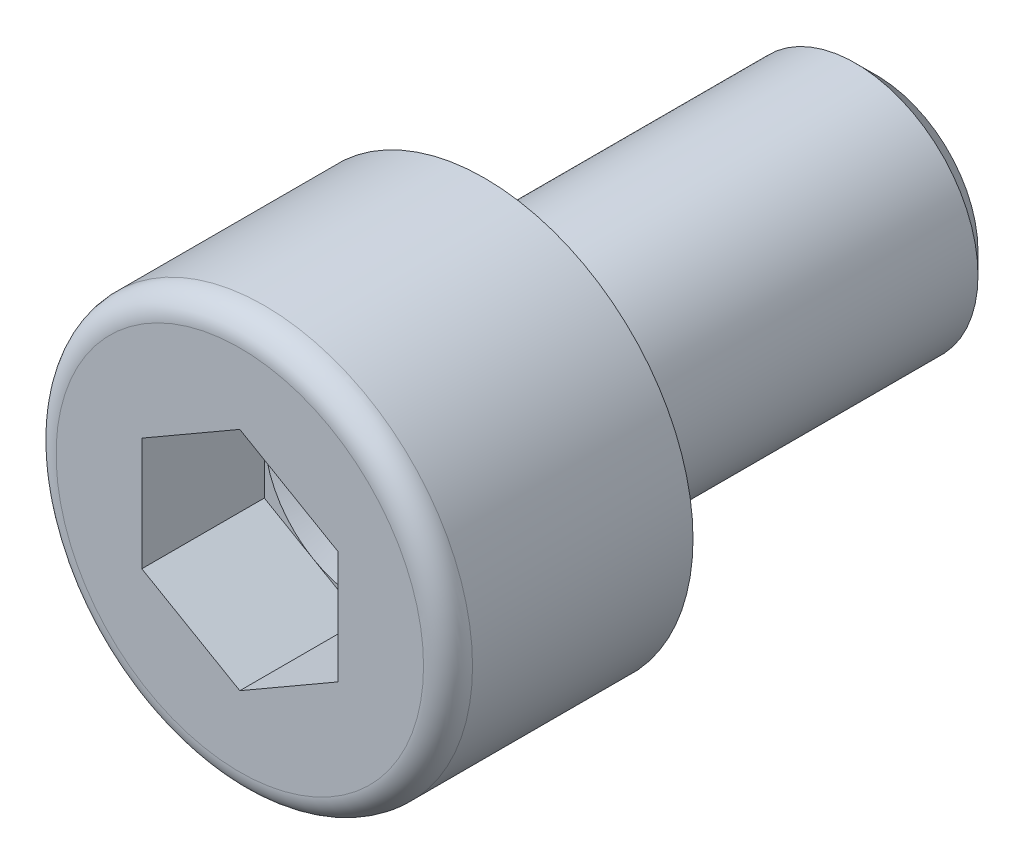
ISO-10303-21;
HEADER;
FILE_DESCRIPTION(('STEP AP214'),'2;1');
FILE_NAME('part.step','',(''),(''),'','','');
FILE_SCHEMA(('AUTOMOTIVE_DESIGN { 1 0 10303 214 1 1 1 1 }'));
ENDSEC;
DATA;
#1=APPLICATION_CONTEXT('core data for automotive mechanical design processes');
#2=APPLICATION_PROTOCOL_DEFINITION('international standard','automotive_design',2000,#1);
#3=PRODUCT_CONTEXT('',#1,'mechanical');
#4=PRODUCT('Part','Part','',(#3));
#5=PRODUCT_RELATED_PRODUCT_CATEGORY('part','',(#4));
#6=PRODUCT_DEFINITION_FORMATION('','',#4);
#7=PRODUCT_DEFINITION_CONTEXT('part definition',#1,'design');
#8=PRODUCT_DEFINITION('design','',#6,#7);
#9=PRODUCT_DEFINITION_SHAPE('','',#8);
#10=(LENGTH_UNIT() NAMED_UNIT(*) SI_UNIT(.MILLI.,.METRE.));
#11=(NAMED_UNIT(*) PLANE_ANGLE_UNIT() SI_UNIT($,.RADIAN.));
#12=(NAMED_UNIT(*) SI_UNIT($,.STERADIAN.) SOLID_ANGLE_UNIT());
#13=UNCERTAINTY_MEASURE_WITH_UNIT(LENGTH_MEASURE(1.E-05),#10,'distance_accuracy_value','');
#14=(GEOMETRIC_REPRESENTATION_CONTEXT(3) GLOBAL_UNCERTAINTY_ASSIGNED_CONTEXT((#13)) GLOBAL_UNIT_ASSIGNED_CONTEXT((#10,
#11,#12)) REPRESENTATION_CONTEXT('',''));
#15=CARTESIAN_POINT('',(0.,0.,0.));
#16=DIRECTION('',(0.,0.,1.));
#17=DIRECTION('',(1.,0.,0.));
#18=AXIS2_PLACEMENT_3D('',#15,#16,#17);
#19=CARTESIAN_POINT('',(0.,0.,-2.5));
#20=DIRECTION('',(0.,0.,1.));
#21=DIRECTION('',(1.,0.,0.));
#22=AXIS2_PLACEMENT_3D('',#19,#20,#21);
#23=PLANE('',#22);
#24=DIRECTION('',(0.,1.,0.));
#25=VECTOR('',#24,1.);
#26=CARTESIAN_POINT('',(-2.,0.,-2.5));
#27=LINE('',#26,#25);
#28=CARTESIAN_POINT('',(-2.,0.,-2.5));
#29=VERTEX_POINT('',#28);
#30=CARTESIAN_POINT('',(-2.,1.15470053837925,-2.5));
#31=VERTEX_POINT('',#30);
#32=EDGE_CURVE('E289',#29,#31,#27,.T.);
#33=ORIENTED_EDGE('',*,*,#32,.F.);
#34=CARTESIAN_POINT('',(0.,0.,-2.5));
#35=DIRECTION('',(0.,0.,-1.));
#36=DIRECTION('',(-1.,0.,0.));
#37=AXIS2_PLACEMENT_3D('',#34,#35,#36);
#38=CIRCLE('',#37,2.);
#39=CARTESIAN_POINT('',(-1.,1.73205080756888,-2.5));
#40=VERTEX_POINT('',#39);
#41=EDGE_CURVE('E38',#29,#40,#38,.T.);
#42=ORIENTED_EDGE('',*,*,#41,.T.);
#43=DIRECTION('',(0.866025403784439,0.5,0.));
#44=VECTOR('',#43,1.);
#45=CARTESIAN_POINT('',(-0.992562637900043,1.73634477057935,-2.5));
#46=LINE('',#45,#44);
#47=EDGE_CURVE('E290',#31,#40,#46,.T.);
#48=ORIENTED_EDGE('',*,*,#47,.F.);
#49=EDGE_LOOP('',(#33,#42,#48));
#50=FACE_BOUND('',#49,.T.);
#51=ADVANCED_FACE('F17',(#50),#23,.T.);
#52=CARTESIAN_POINT('',(0.,2.30940107675851,-2.5));
#53=VERTEX_POINT('',#52);
#54=EDGE_CURVE('E294',#40,#53,#46,.T.);
#55=ORIENTED_EDGE('',*,*,#54,.F.);
#56=CARTESIAN_POINT('',(1.,1.73205080756888,-2.5));
#57=VERTEX_POINT('',#56);
#58=EDGE_CURVE('E305',#40,#57,#38,.T.);
#59=ORIENTED_EDGE('',*,*,#58,.T.);
#60=DIRECTION('',(0.866025403784439,-0.5,0.));
#61=VECTOR('',#60,1.);
#62=CARTESIAN_POINT('',(1.,1.73205080756888,-2.5));
#63=LINE('',#62,#61);
#64=EDGE_CURVE('E295',#53,#57,#63,.T.);
#65=ORIENTED_EDGE('',*,*,#64,.F.);
#66=EDGE_LOOP('',(#55,#59,#65));
#67=FACE_BOUND('',#66,.T.);
#68=ADVANCED_FACE('F134',(#67),#23,.T.);
#69=CARTESIAN_POINT('',(2.,1.15470053837925,-2.5));
#70=VERTEX_POINT('',#69);
#71=EDGE_CURVE('E299',#57,#70,#63,.T.);
#72=ORIENTED_EDGE('',*,*,#71,.F.);
#73=CARTESIAN_POINT('',(2.,0.,-2.5));
#74=VERTEX_POINT('',#73);
#75=EDGE_CURVE('E313',#57,#74,#38,.T.);
#76=ORIENTED_EDGE('',*,*,#75,.T.);
#77=DIRECTION('',(0.,-1.,0.));
#78=VECTOR('',#77,1.);
#79=CARTESIAN_POINT('',(2.,0.,-2.5));
#80=LINE('',#79,#78);
#81=EDGE_CURVE('E300',#70,#74,#80,.T.);
#82=ORIENTED_EDGE('',*,*,#81,.F.);
#83=EDGE_LOOP('',(#72,#76,#82));
#84=FACE_BOUND('',#83,.T.);
#85=ADVANCED_FACE('F139',(#84),#23,.T.);
#86=CARTESIAN_POINT('',(2.,-1.15470053837925,-2.5));
#87=VERTEX_POINT('',#86);
#88=EDGE_CURVE('E257',#74,#87,#80,.T.);
#89=ORIENTED_EDGE('',*,*,#88,.F.);
#90=CARTESIAN_POINT('',(1.,-1.73205080756888,-2.5));
#91=VERTEX_POINT('',#90);
#92=EDGE_CURVE('E321',#74,#91,#38,.T.);
#93=ORIENTED_EDGE('',*,*,#92,.T.);
#94=DIRECTION('',(-0.866025403784439,-0.5,0.));
#95=VECTOR('',#94,1.);
#96=CARTESIAN_POINT('',(0.971250214161918,-1.74864950416164,-2.5));
#97=LINE('',#96,#95);
#98=EDGE_CURVE('E252',#87,#91,#97,.T.);
#99=ORIENTED_EDGE('',*,*,#98,.F.);
#100=EDGE_LOOP('',(#89,#93,#99));
#101=FACE_BOUND('',#100,.T.);
#102=ADVANCED_FACE('F338',(#101),#23,.T.);
#103=CARTESIAN_POINT('',(0.,-2.30940107675851,-2.5));
#104=VERTEX_POINT('',#103);
#105=EDGE_CURVE('E279',#91,#104,#97,.T.);
#106=ORIENTED_EDGE('',*,*,#105,.F.);
#107=CARTESIAN_POINT('',(-1.,-1.73205080756888,-2.5));
#108=VERTEX_POINT('',#107);
#109=EDGE_CURVE('E314',#91,#108,#38,.T.);
#110=ORIENTED_EDGE('',*,*,#109,.T.);
#111=DIRECTION('',(-0.866025403784439,0.5,0.));
#112=VECTOR('',#111,1.);
#113=CARTESIAN_POINT('',(-1.,-1.73205080756888,-2.5));
#114=LINE('',#113,#112);
#115=EDGE_CURVE('E280',#104,#108,#114,.T.);
#116=ORIENTED_EDGE('',*,*,#115,.F.);
#117=EDGE_LOOP('',(#106,#110,#116));
#118=FACE_BOUND('',#117,.T.);
#119=ADVANCED_FACE('F132',(#118),#23,.T.);
#120=CARTESIAN_POINT('',(-1.10172582585694,0.,0.));
#121=DIRECTION('',(0.,0.,-1.));
#122=DIRECTION('',(-1.,0.,0.));
#123=AXIS2_PLACEMENT_3D('',#120,#121,#122);
#124=PLANE('',#123);
#125=CARTESIAN_POINT('',(0.,0.,0.));
#126=DIRECTION('',(0.,0.,1.));
#127=DIRECTION('',(1.,0.,0.));
#128=AXIS2_PLACEMENT_3D('',#125,#126,#127);
#129=CIRCLE('',#128,3.75);
#130=CARTESIAN_POINT('',(3.75,0.,0.));
#131=VERTEX_POINT('',#130);
#132=EDGE_CURVE('E222',#131,#131,#129,.T.);
#133=ORIENTED_EDGE('',*,*,#132,.T.);
#134=EDGE_LOOP('',(#133));
#135=FACE_BOUND('',#134,.T.);
#136=DIRECTION('',(0.,-1.,0.));
#137=VECTOR('',#136,1.);
#138=CARTESIAN_POINT('',(2.,0.,0.));
#139=LINE('',#138,#137);
#140=CARTESIAN_POINT('',(2.,1.15470053837925,0.));
#141=VERTEX_POINT('',#140);
#142=CARTESIAN_POINT('',(2.,-1.15470053837925,0.));
#143=VERTEX_POINT('',#142);
#144=EDGE_CURVE('E272',#141,#143,#139,.T.);
#145=ORIENTED_EDGE('',*,*,#144,.T.);
#146=DIRECTION('',(-0.866025403784439,-0.5,0.));
#147=VECTOR('',#146,1.);
#148=CARTESIAN_POINT('',(0.971250214161918,-1.74864950416164,0.));
#149=LINE('',#148,#147);
#150=CARTESIAN_POINT('',(0.,-2.30940107675851,0.));
#151=VERTEX_POINT('',#150);
#152=EDGE_CURVE('E253',#143,#151,#149,.T.);
#153=ORIENTED_EDGE('',*,*,#152,.T.);
#154=DIRECTION('',(-0.866025403784439,0.5,0.));
#155=VECTOR('',#154,1.);
#156=CARTESIAN_POINT('',(-1.,-1.73205080756888,0.));
#157=LINE('',#156,#155);
#158=CARTESIAN_POINT('',(-2.,-1.15470053837925,0.));
#159=VERTEX_POINT('',#158);
#160=EDGE_CURVE('E50',#151,#159,#157,.T.);
#161=ORIENTED_EDGE('',*,*,#160,.T.);
#162=DIRECTION('',(0.,1.,0.));
#163=VECTOR('',#162,1.);
#164=CARTESIAN_POINT('',(-2.,0.,0.));
#165=LINE('',#164,#163);
#166=CARTESIAN_POINT('',(-2.,1.15470053837925,0.));
#167=VERTEX_POINT('',#166);
#168=EDGE_CURVE('E260',#159,#167,#165,.T.);
#169=ORIENTED_EDGE('',*,*,#168,.T.);
#170=DIRECTION('',(0.866025403784439,0.5,0.));
#171=VECTOR('',#170,1.);
#172=CARTESIAN_POINT('',(-0.992562637900043,1.73634477057935,0.));
#173=LINE('',#172,#171);
#174=CARTESIAN_POINT('',(0.,2.30940107675851,0.));
#175=VERTEX_POINT('',#174);
#176=EDGE_CURVE('E264',#167,#175,#173,.T.);
#177=ORIENTED_EDGE('',*,*,#176,.T.);
#178=DIRECTION('',(0.866025403784439,-0.5,0.));
#179=VECTOR('',#178,1.);
#180=CARTESIAN_POINT('',(1.,1.73205080756888,0.));
#181=LINE('',#180,#179);
#182=EDGE_CURVE('E268',#175,#141,#181,.T.);
#183=ORIENTED_EDGE('',*,*,#182,.T.);
#184=EDGE_LOOP('',(#145,#153,#161,#169,#177,#183));
#185=FACE_BOUND('',#184,.T.);
#186=ADVANCED_FACE('F184',(#135,#185),#124,.F.);
#187=CARTESIAN_POINT('',(0.,0.,-0.5));
#188=DIRECTION('',(0.,0.,1.));
#189=DIRECTION('',(1.,0.,0.));
#190=AXIS2_PLACEMENT_3D('',#187,#188,#189);
#191=TOROIDAL_SURFACE('',#190,3.75,0.5);
#192=CARTESIAN_POINT('',(0.,0.,-0.5));
#193=DIRECTION('',(0.,0.,1.));
#194=DIRECTION('',(1.,0.,0.));
#195=AXIS2_PLACEMENT_3D('',#192,#193,#194);
#196=CIRCLE('',#195,4.25);
#197=CARTESIAN_POINT('',(4.25,0.,-0.5));
#198=VERTEX_POINT('',#197);
#199=EDGE_CURVE('E226',#198,#198,#196,.T.);
#200=ORIENTED_EDGE('',*,*,#199,.T.);
#201=EDGE_LOOP('',(#200));
#202=FACE_BOUND('',#201,.T.);
#203=ORIENTED_EDGE('',*,*,#132,.F.);
#204=EDGE_LOOP('',(#203));
#205=FACE_BOUND('',#204,.T.);
#206=ADVANCED_FACE('F180',(#202,#205),#191,.T.);
#207=CARTESIAN_POINT('',(0.,0.,-6.5));
#208=DIRECTION('',(0.,0.,1.));
#209=DIRECTION('',(1.,0.,0.));
#210=AXIS2_PLACEMENT_3D('',#207,#208,#209);
#211=CYLINDRICAL_SURFACE('',#210,4.25);
#212=ORIENTED_EDGE('',*,*,#199,.F.);
#213=EDGE_LOOP('',(#212));
#214=FACE_BOUND('',#213,.T.);
#215=CARTESIAN_POINT('',(0.,0.,-5.));
#216=DIRECTION('',(0.,0.,1.));
#217=DIRECTION('',(1.,0.,0.));
#218=AXIS2_PLACEMENT_3D('',#215,#216,#217);
#219=CIRCLE('',#218,4.25);
#220=CARTESIAN_POINT('',(4.25,0.,-5.));
#221=VERTEX_POINT('',#220);
#222=EDGE_CURVE('E230',#221,#221,#219,.T.);
#223=ORIENTED_EDGE('',*,*,#222,.T.);
#224=EDGE_LOOP('',(#223));
#225=FACE_BOUND('',#224,.T.);
#226=ADVANCED_FACE('F176',(#214,#225),#211,.T.);
#227=CARTESIAN_POINT('',(-1.61056634651914,0.,-5.));
#228=DIRECTION('',(0.,0.,1.));
#229=DIRECTION('',(1.,0.,0.));
#230=AXIS2_PLACEMENT_3D('',#227,#228,#229);
#231=PLANE('',#230);
#232=CARTESIAN_POINT('',(0.,0.,-5.));
#233=DIRECTION('',(0.,0.,1.));
#234=DIRECTION('',(1.,0.,0.));
#235=AXIS2_PLACEMENT_3D('',#232,#233,#234);
#236=CIRCLE('',#235,2.96487406649083);
#237=CARTESIAN_POINT('',(2.96487406649083,0.,-5.));
#238=VERTEX_POINT('',#237);
#239=EDGE_CURVE('E204',#238,#238,#236,.T.);
#240=ORIENTED_EDGE('',*,*,#239,.T.);
#241=EDGE_LOOP('',(#240));
#242=FACE_BOUND('',#241,.T.);
#243=ORIENTED_EDGE('',*,*,#222,.F.);
#244=EDGE_LOOP('',(#243));
#245=FACE_BOUND('',#244,.T.);
#246=ADVANCED_FACE('F172',(#242,#245),#231,.F.);
#247=CARTESIAN_POINT('',(0.,0.,-6.5));
#248=DIRECTION('',(0.,0.,1.));
#249=DIRECTION('',(1.,0.,0.));
#250=AXIS2_PLACEMENT_3D('',#247,#248,#249);
#251=CYLINDRICAL_SURFACE('',#250,2.5);
#252=CARTESIAN_POINT('',(0.,0.,-12.5669873));
#253=DIRECTION('',(0.,0.,1.));
#254=DIRECTION('',(1.,0.,0.));
#255=AXIS2_PLACEMENT_3D('',#252,#253,#254);
#256=CIRCLE('',#255,2.5);
#257=CARTESIAN_POINT('',(2.5,0.,-12.5669873));
#258=VERTEX_POINT('',#257);
#259=EDGE_CURVE('E26',#258,#258,#256,.T.);
#260=ORIENTED_EDGE('',*,*,#259,.T.);
#261=EDGE_LOOP('',(#260));
#262=FACE_BOUND('',#261,.T.);
#263=CARTESIAN_POINT('',(0.,0.,-5.65406982827));
#264=DIRECTION('',(0.,0.,-1.));
#265=DIRECTION('',(-1.,0.,0.));
#266=AXIS2_PLACEMENT_3D('',#263,#264,#265);
#267=CIRCLE('',#266,2.5);
#268=CARTESIAN_POINT('',(-2.5,0.,-5.65406982827));
#269=VERTEX_POINT('',#268);
#270=EDGE_CURVE('E218',#269,#269,#267,.T.);
#271=ORIENTED_EDGE('',*,*,#270,.T.);
#272=EDGE_LOOP('',(#271));
#273=FACE_BOUND('',#272,.T.);
#274=ADVANCED_FACE('F168',(#262,#273),#251,.T.);
#275=CARTESIAN_POINT('',(-0.508840520662192,0.,-13.));
#276=DIRECTION('',(0.,0.,1.));
#277=DIRECTION('',(1.,0.,0.));
#278=AXIS2_PLACEMENT_3D('',#275,#276,#277);
#279=PLANE('',#278);
#280=CARTESIAN_POINT('',(0.,0.,-13.));
#281=DIRECTION('',(0.,0.,1.));
#282=DIRECTION('',(1.,0.,0.));
#283=AXIS2_PLACEMENT_3D('',#280,#281,#282);
#284=CIRCLE('',#283,2.06698729999999);
#285=CARTESIAN_POINT('',(2.06698729999999,0.,-13.));
#286=VERTEX_POINT('',#285);
#287=EDGE_CURVE('E11',#286,#286,#284,.F.);
#288=ORIENTED_EDGE('',*,*,#287,.T.);
#289=EDGE_LOOP('',(#288));
#290=FACE_BOUND('',#289,.T.);
#291=ADVANCED_FACE('F164',(#290),#279,.F.);
#292=CARTESIAN_POINT('',(2.,0.,-2.5));
#293=DIRECTION('',(-1.,0.,0.));
#294=DIRECTION('',(0.,-1.,0.));
#295=AXIS2_PLACEMENT_3D('',#292,#293,#294);
#296=PLANE('',#295);
#297=ORIENTED_EDGE('',*,*,#144,.F.);
#298=DIRECTION('',(0.,0.,1.));
#299=VECTOR('',#298,1.);
#300=CARTESIAN_POINT('',(2.,1.15470053837925,-2.5));
#301=LINE('',#300,#299);
#302=EDGE_CURVE('E234',#70,#141,#301,.T.);
#303=ORIENTED_EDGE('',*,*,#302,.F.);
#304=ORIENTED_EDGE('',*,*,#81,.T.);
#305=ORIENTED_EDGE('',*,*,#88,.T.);
#306=DIRECTION('',(0.,0.,1.));
#307=VECTOR('',#306,1.);
#308=CARTESIAN_POINT('',(2.,-1.15470053837925,-2.5));
#309=LINE('',#308,#307);
#310=EDGE_CURVE('E249',#87,#143,#309,.T.);
#311=ORIENTED_EDGE('',*,*,#310,.T.);
#312=EDGE_LOOP('',(#297,#303,#304,#305,#311));
#313=FACE_BOUND('',#312,.T.);
#314=ADVANCED_FACE('F160',(#313),#296,.T.);
#315=CARTESIAN_POINT('',(1.,1.73205080756888,-2.5));
#316=DIRECTION('',(-0.5,-0.866025403784439,0.));
#317=DIRECTION('',(0.866025403784439,-0.5,0.));
#318=AXIS2_PLACEMENT_3D('',#315,#316,#317);
#319=PLANE('',#318);
#320=ORIENTED_EDGE('',*,*,#182,.F.);
#321=DIRECTION('',(0.,0.,1.));
#322=VECTOR('',#321,1.);
#323=CARTESIAN_POINT('',(0.,2.30940107675851,-2.5));
#324=LINE('',#323,#322);
#325=EDGE_CURVE('E237',#53,#175,#324,.T.);
#326=ORIENTED_EDGE('',*,*,#325,.F.);
#327=ORIENTED_EDGE('',*,*,#64,.T.);
#328=ORIENTED_EDGE('',*,*,#71,.T.);
#329=ORIENTED_EDGE('',*,*,#302,.T.);
#330=EDGE_LOOP('',(#320,#326,#327,#328,#329));
#331=FACE_BOUND('',#330,.T.);
#332=ADVANCED_FACE('F156',(#331),#319,.T.);
#333=CARTESIAN_POINT('',(-0.992562637900043,1.73634477057935,-2.5));
#334=DIRECTION('',(0.5,-0.866025403784439,0.));
#335=DIRECTION('',(0.866025403784439,0.5,0.));
#336=AXIS2_PLACEMENT_3D('',#333,#334,#335);
#337=PLANE('',#336);
#338=ORIENTED_EDGE('',*,*,#176,.F.);
#339=DIRECTION('',(0.,0.,1.));
#340=VECTOR('',#339,1.);
#341=CARTESIAN_POINT('',(-2.,1.15470053837925,-2.5));
#342=LINE('',#341,#340);
#343=EDGE_CURVE('E240',#31,#167,#342,.T.);
#344=ORIENTED_EDGE('',*,*,#343,.F.);
#345=ORIENTED_EDGE('',*,*,#47,.T.);
#346=ORIENTED_EDGE('',*,*,#54,.T.);
#347=ORIENTED_EDGE('',*,*,#325,.T.);
#348=EDGE_LOOP('',(#338,#344,#345,#346,#347));
#349=FACE_BOUND('',#348,.T.);
#350=ADVANCED_FACE('F152',(#349),#337,.T.);
#351=CARTESIAN_POINT('',(-2.,0.,-2.5));
#352=DIRECTION('',(1.,0.,0.));
#353=DIRECTION('',(0.,1.,0.));
#354=AXIS2_PLACEMENT_3D('',#351,#352,#353);
#355=PLANE('',#354);
#356=ORIENTED_EDGE('',*,*,#168,.F.);
#357=DIRECTION('',(0.,0.,1.));
#358=VECTOR('',#357,1.);
#359=CARTESIAN_POINT('',(-2.,-1.15470053837925,-2.5));
#360=LINE('',#359,#358);
#361=CARTESIAN_POINT('',(-2.,-1.15470053837925,-2.5));
#362=VERTEX_POINT('',#361);
#363=EDGE_CURVE('E243',#362,#159,#360,.T.);
#364=ORIENTED_EDGE('',*,*,#363,.F.);
#365=EDGE_CURVE('E285',#362,#29,#27,.T.);
#366=ORIENTED_EDGE('',*,*,#365,.T.);
#367=ORIENTED_EDGE('',*,*,#32,.T.);
#368=ORIENTED_EDGE('',*,*,#343,.T.);
#369=EDGE_LOOP('',(#356,#364,#366,#367,#368));
#370=FACE_BOUND('',#369,.T.);
#371=ADVANCED_FACE('F149',(#370),#355,.T.);
#372=CARTESIAN_POINT('',(-1.,-1.73205080756888,-2.5));
#373=DIRECTION('',(0.5,0.866025403784439,0.));
#374=DIRECTION('',(-0.866025403784439,0.5,0.));
#375=AXIS2_PLACEMENT_3D('',#372,#373,#374);
#376=PLANE('',#375);
#377=ORIENTED_EDGE('',*,*,#160,.F.);
#378=DIRECTION('',(0.,0.,1.));
#379=VECTOR('',#378,1.);
#380=CARTESIAN_POINT('',(0.,-2.30940107675851,-2.5));
#381=LINE('',#380,#379);
#382=EDGE_CURVE('E246',#104,#151,#381,.T.);
#383=ORIENTED_EDGE('',*,*,#382,.F.);
#384=ORIENTED_EDGE('',*,*,#115,.T.);
#385=EDGE_CURVE('E284',#108,#362,#114,.T.);
#386=ORIENTED_EDGE('',*,*,#385,.T.);
#387=ORIENTED_EDGE('',*,*,#363,.T.);
#388=EDGE_LOOP('',(#377,#383,#384,#386,#387));
#389=FACE_BOUND('',#388,.T.);
#390=ADVANCED_FACE('F145',(#389),#376,.T.);
#391=CARTESIAN_POINT('',(0.971250214161918,-1.74864950416164,-2.5));
#392=DIRECTION('',(-0.5,0.866025403784439,0.));
#393=DIRECTION('',(-0.866025403784439,-0.5,0.));
#394=AXIS2_PLACEMENT_3D('',#391,#392,#393);
#395=PLANE('',#394);
#396=ORIENTED_EDGE('',*,*,#152,.F.);
#397=ORIENTED_EDGE('',*,*,#310,.F.);
#398=ORIENTED_EDGE('',*,*,#98,.T.);
#399=ORIENTED_EDGE('',*,*,#105,.T.);
#400=ORIENTED_EDGE('',*,*,#382,.T.);
#401=EDGE_LOOP('',(#396,#397,#398,#399,#400));
#402=FACE_BOUND('',#401,.T.);
#403=ADVANCED_FACE('F129',(#402),#395,.T.);
#404=ORIENTED_EDGE('',*,*,#385,.F.);
#405=EDGE_CURVE('E306',#108,#29,#38,.T.);
#406=ORIENTED_EDGE('',*,*,#405,.T.);
#407=ORIENTED_EDGE('',*,*,#365,.F.);
#408=EDGE_LOOP('',(#404,#406,#407));
#409=FACE_BOUND('',#408,.T.);
#410=ADVANCED_FACE('F119',(#409),#23,.T.);
#411=CARTESIAN_POINT('',(0.,0.,-2.5));
#412=DIRECTION('',(0.,0.,1.));
#413=DIRECTION('',(1.,0.,0.));
#414=AXIS2_PLACEMENT_3D('',#411,#412,#413);
#415=CONICAL_SURFACE('',#414,2.,1.22173047639603);
#416=CARTESIAN_POINT('',(0.,0.,-3.2279404685324));
#417=VERTEX_POINT('',#416);
#418=VERTEX_LOOP('',#417);
#419=FACE_BOUND('',#418,.T.);
#420=ORIENTED_EDGE('',*,*,#41,.F.);
#421=ORIENTED_EDGE('',*,*,#405,.F.);
#422=ORIENTED_EDGE('',*,*,#109,.F.);
#423=ORIENTED_EDGE('',*,*,#92,.F.);
#424=ORIENTED_EDGE('',*,*,#75,.F.);
#425=ORIENTED_EDGE('',*,*,#58,.F.);
#426=EDGE_LOOP('',(#420,#421,#422,#423,#424,#425));
#427=FACE_BOUND('',#426,.T.);
#428=ADVANCED_FACE('F116',(#419,#427),#415,.F.);
#429=CARTESIAN_POINT('',(0.,0.,-5.));
#430=DIRECTION('',(0.,0.,1.));
#431=DIRECTION('',(1.,0.,0.));
#432=AXIS2_PLACEMENT_3D('',#429,#430,#431);
#433=CONICAL_SURFACE('',#432,2.85,0.528074448426359);
#434=CARTESIAN_POINT('',(0.,0.,-5.55329562316518));
#435=DIRECTION('',(0.,0.,1.));
#436=DIRECTION('',(1.,0.,0.));
#437=AXIS2_PLACEMENT_3D('',#434,#435,#436);
#438=CIRCLE('',#437,2.52724421982031);
#439=CARTESIAN_POINT('',(2.52724421982031,0.,-5.55329562316518));
#440=VERTEX_POINT('',#439);
#441=EDGE_CURVE('E206',#440,#440,#438,.T.);
#442=ORIENTED_EDGE('',*,*,#441,.T.);
#443=EDGE_LOOP('',(#442));
#444=FACE_BOUND('',#443,.T.);
#445=CARTESIAN_POINT('',(0.,0.,-5.09922579489518));
#446=DIRECTION('',(0.,0.,1.));
#447=DIRECTION('',(1.,0.,0.));
#448=AXIS2_PLACEMENT_3D('',#445,#446,#447);
#449=CIRCLE('',#448,2.79211828631114);
#450=CARTESIAN_POINT('',(2.79211828631114,0.,-5.09922579489518));
#451=VERTEX_POINT('',#450);
#452=EDGE_CURVE('E201',#451,#451,#449,.F.);
#453=ORIENTED_EDGE('',*,*,#452,.T.);
#454=EDGE_LOOP('',(#453));
#455=FACE_BOUND('',#454,.T.);
#456=ADVANCED_FACE('F118',(#444,#455),#433,.T.);
#457=CARTESIAN_POINT('',(0.,0.,-5.65406982827));
#458=DIRECTION('',(0.,0.,-1.));
#459=DIRECTION('',(-1.,0.,0.));
#460=AXIS2_PLACEMENT_3D('',#457,#458,#459);
#461=TOROIDAL_SURFACE('',#460,2.7,0.2);
#462=ORIENTED_EDGE('',*,*,#441,.F.);
#463=EDGE_LOOP('',(#462));
#464=FACE_BOUND('',#463,.T.);
#465=ORIENTED_EDGE('',*,*,#270,.F.);
#466=EDGE_LOOP('',(#465));
#467=FACE_BOUND('',#466,.T.);
#468=ADVANCED_FACE('F126',(#464,#467),#461,.F.);
#469=CARTESIAN_POINT('',(0.,0.,-5.2));
#470=DIRECTION('',(0.,0.,1.));
#471=DIRECTION('',(1.,0.,0.));
#472=AXIS2_PLACEMENT_3D('',#469,#470,#471);
#473=TOROIDAL_SURFACE('',#472,2.96487406649083,0.2);
#474=ORIENTED_EDGE('',*,*,#452,.F.);
#475=EDGE_LOOP('',(#474));
#476=FACE_BOUND('',#475,.T.);
#477=ORIENTED_EDGE('',*,*,#239,.F.);
#478=EDGE_LOOP('',(#477));
#479=FACE_BOUND('',#478,.T.);
#480=ADVANCED_FACE('F190',(#476,#479),#473,.F.);
#481=CARTESIAN_POINT('',(0.,0.,-12.5669873));
#482=DIRECTION('',(0.,0.,1.));
#483=DIRECTION('',(1.,0.,0.));
#484=AXIS2_PLACEMENT_3D('',#481,#482,#483);
#485=CONICAL_SURFACE('',#484,2.5,0.785398163397448);
#486=ORIENTED_EDGE('',*,*,#287,.F.);
#487=EDGE_LOOP('',(#486));
#488=FACE_BOUND('',#487,.T.);
#489=ORIENTED_EDGE('',*,*,#259,.F.);
#490=EDGE_LOOP('',(#489));
#491=FACE_BOUND('',#490,.T.);
#492=ADVANCED_FACE('F19',(#488,#491),#485,.T.);
#493=CLOSED_SHELL('',(#51,#68,#85,#102,#119,#186,#206,#226,#246,#274,#291,#314,#332,#350,#371,
#390,#403,#410,#428,#456,#468,#480,#492));
#494=MANIFOLD_SOLID_BREP('B1',#493);
#495=ADVANCED_BREP_SHAPE_REPRESENTATION('',(#18,#494),#14);
#496=SHAPE_DEFINITION_REPRESENTATION(#9,#495);
ENDSEC;
END-ISO-10303-21;
